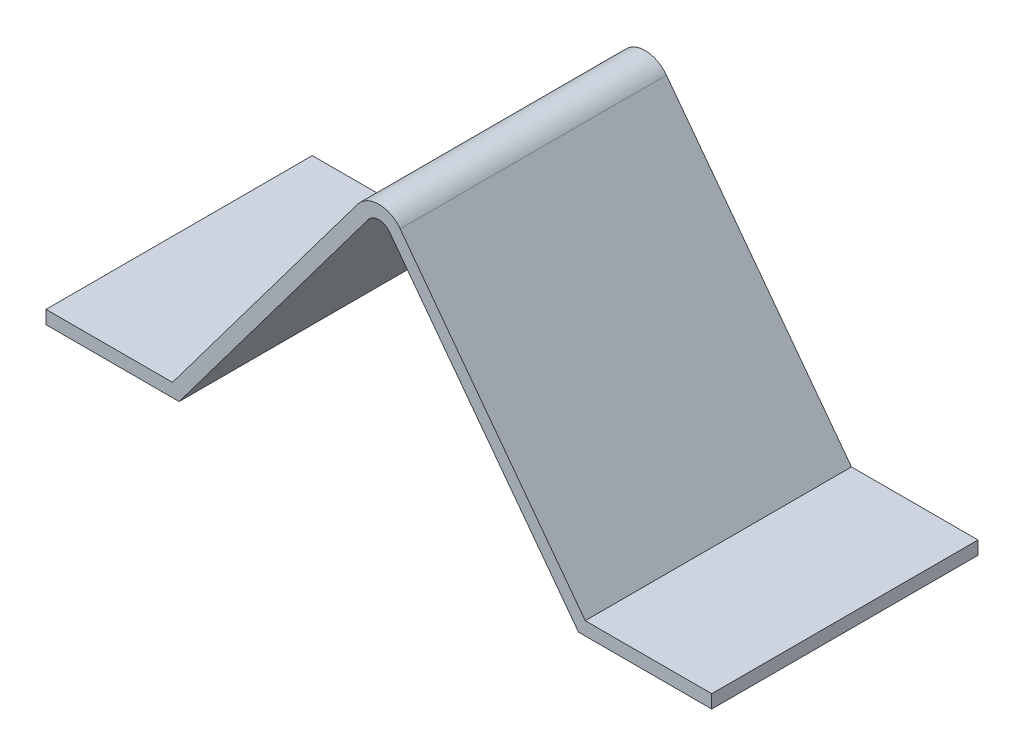
ISO-10303-21;
HEADER;
FILE_DESCRIPTION(('STEP AP214'),'2;1');
FILE_NAME('part.step','',(''),(''),'','','');
FILE_SCHEMA(('AUTOMOTIVE_DESIGN { 1 0 10303 214 1 1 1 1 }'));
ENDSEC;
DATA;
#1=APPLICATION_CONTEXT('core data for automotive mechanical design processes');
#2=APPLICATION_PROTOCOL_DEFINITION('international standard','automotive_design',2000,#1);
#3=PRODUCT_CONTEXT('',#1,'mechanical');
#4=PRODUCT('Part','Part','',(#3));
#5=PRODUCT_RELATED_PRODUCT_CATEGORY('part','',(#4));
#6=PRODUCT_DEFINITION_FORMATION('','',#4);
#7=PRODUCT_DEFINITION_CONTEXT('part definition',#1,'design');
#8=PRODUCT_DEFINITION('design','',#6,#7);
#9=PRODUCT_DEFINITION_SHAPE('','',#8);
#10=(LENGTH_UNIT() NAMED_UNIT(*) SI_UNIT(.MILLI.,.METRE.));
#11=(NAMED_UNIT(*) PLANE_ANGLE_UNIT() SI_UNIT($,.RADIAN.));
#12=(NAMED_UNIT(*) SI_UNIT($,.STERADIAN.) SOLID_ANGLE_UNIT());
#13=UNCERTAINTY_MEASURE_WITH_UNIT(LENGTH_MEASURE(1.E-05),#10,'distance_accuracy_value','');
#14=(GEOMETRIC_REPRESENTATION_CONTEXT(3) GLOBAL_UNCERTAINTY_ASSIGNED_CONTEXT((#13)) GLOBAL_UNIT_ASSIGNED_CONTEXT((#10,
#11,#12)) REPRESENTATION_CONTEXT('',''));
#15=CARTESIAN_POINT('',(0.,0.,0.));
#16=DIRECTION('',(0.,0.,1.));
#17=DIRECTION('',(1.,0.,0.));
#18=AXIS2_PLACEMENT_3D('',#15,#16,#17);
#19=CARTESIAN_POINT('',(-15.,0.,10.));
#20=DIRECTION('',(0.,1.,0.));
#21=DIRECTION('',(-1.,0.,0.));
#22=AXIS2_PLACEMENT_3D('',#19,#20,#21);
#23=PLANE('',#22);
#24=DIRECTION('',(1.,0.,0.));
#25=VECTOR('',#24,1.);
#26=CARTESIAN_POINT('',(-15.,0.,-10.));
#27=LINE('',#26,#25);
#28=CARTESIAN_POINT('',(-25.,0.,-10.));
#29=VERTEX_POINT('',#28);
#30=CARTESIAN_POINT('',(-15.,0.,-10.));
#31=VERTEX_POINT('',#30);
#32=EDGE_CURVE('E148',#29,#31,#27,.T.);
#33=ORIENTED_EDGE('',*,*,#32,.T.);
#34=DIRECTION('',(0.,0.,-1.));
#35=VECTOR('',#34,1.);
#36=CARTESIAN_POINT('',(-15.,0.,10.));
#37=LINE('',#36,#35);
#38=CARTESIAN_POINT('',(-15.,0.,10.));
#39=VERTEX_POINT('',#38);
#40=EDGE_CURVE('E129',#39,#31,#37,.T.);
#41=ORIENTED_EDGE('',*,*,#40,.F.);
#42=DIRECTION('',(1.,0.,0.));
#43=VECTOR('',#42,1.);
#44=CARTESIAN_POINT('',(-15.,0.,10.));
#45=LINE('',#44,#43);
#46=CARTESIAN_POINT('',(-25.,0.,10.));
#47=VERTEX_POINT('',#46);
#48=EDGE_CURVE('E136',#47,#39,#45,.T.);
#49=ORIENTED_EDGE('',*,*,#48,.F.);
#50=DIRECTION('',(0.,0.,-1.));
#51=VECTOR('',#50,1.);
#52=CARTESIAN_POINT('',(-25.,0.,10.));
#53=LINE('',#52,#51);
#54=EDGE_CURVE('E189',#47,#29,#53,.T.);
#55=ORIENTED_EDGE('',*,*,#54,.T.);
#56=EDGE_LOOP('',(#33,#41,#49,#55));
#57=FACE_BOUND('',#56,.T.);
#58=ADVANCED_FACE('F35',(#57),#23,.F.);
#59=CARTESIAN_POINT('',(-15.,0.,10.));
#60=DIRECTION('',(-0.8,0.6,0.));
#61=DIRECTION('',(-0.6,-0.8,0.));
#62=AXIS2_PLACEMENT_3D('',#59,#60,#61);
#63=PLANE('',#62);
#64=DIRECTION('',(0.6,0.8,0.));
#65=VECTOR('',#64,1.);
#66=CARTESIAN_POINT('',(-15.,0.,-10.));
#67=LINE('',#66,#65);
#68=CARTESIAN_POINT('',(-0.799999999999999,18.9333333333333,-10.));
#69=VERTEX_POINT('',#68);
#70=EDGE_CURVE('E221',#31,#69,#67,.T.);
#71=ORIENTED_EDGE('',*,*,#70,.T.);
#72=DIRECTION('',(0.,0.,-1.));
#73=VECTOR('',#72,1.);
#74=CARTESIAN_POINT('',(-0.799999999999998,18.9333333333333,10.));
#75=LINE('',#74,#73);
#76=CARTESIAN_POINT('',(-0.799999999999999,18.9333333333333,10.));
#77=VERTEX_POINT('',#76);
#78=EDGE_CURVE('E132',#69,#77,#75,.F.);
#79=ORIENTED_EDGE('',*,*,#78,.T.);
#80=DIRECTION('',(0.6,0.8,0.));
#81=VECTOR('',#80,1.);
#82=CARTESIAN_POINT('',(-15.,0.,10.));
#83=LINE('',#82,#81);
#84=EDGE_CURVE('E124',#39,#77,#83,.T.);
#85=ORIENTED_EDGE('',*,*,#84,.F.);
#86=ORIENTED_EDGE('',*,*,#40,.T.);
#87=EDGE_LOOP('',(#71,#79,#85,#86));
#88=FACE_BOUND('',#87,.T.);
#89=ADVANCED_FACE('F127',(#88),#63,.F.);
#90=CARTESIAN_POINT('',(15.,0.,10.));
#91=DIRECTION('',(0.8,0.6,0.));
#92=DIRECTION('',(-0.6,0.8,0.));
#93=AXIS2_PLACEMENT_3D('',#90,#91,#92);
#94=PLANE('',#93);
#95=DIRECTION('',(0.6,-0.8,0.));
#96=VECTOR('',#95,1.);
#97=CARTESIAN_POINT('',(15.,0.,10.));
#98=LINE('',#97,#96);
#99=CARTESIAN_POINT('',(0.799999999999999,18.9333333333333,10.));
#100=VERTEX_POINT('',#99);
#101=CARTESIAN_POINT('',(15.,0.,10.));
#102=VERTEX_POINT('',#101);
#103=EDGE_CURVE('E135',#100,#102,#98,.T.);
#104=ORIENTED_EDGE('',*,*,#103,.F.);
#105=DIRECTION('',(0.,0.,-1.));
#106=VECTOR('',#105,1.);
#107=CARTESIAN_POINT('',(0.799999999999999,18.9333333333333,-10.));
#108=LINE('',#107,#106);
#109=CARTESIAN_POINT('',(0.799999999999999,18.9333333333333,-10.));
#110=VERTEX_POINT('',#109);
#111=EDGE_CURVE('E149',#100,#110,#108,.T.);
#112=ORIENTED_EDGE('',*,*,#111,.T.);
#113=DIRECTION('',(0.6,-0.8,0.));
#114=VECTOR('',#113,1.);
#115=CARTESIAN_POINT('',(15.,0.,-10.));
#116=LINE('',#115,#114);
#117=CARTESIAN_POINT('',(15.,0.,-10.));
#118=VERTEX_POINT('',#117);
#119=EDGE_CURVE('E217',#110,#118,#116,.T.);
#120=ORIENTED_EDGE('',*,*,#119,.T.);
#121=DIRECTION('',(0.,0.,-1.));
#122=VECTOR('',#121,1.);
#123=CARTESIAN_POINT('',(15.,0.,10.));
#124=LINE('',#123,#122);
#125=EDGE_CURVE('E150',#102,#118,#124,.T.);
#126=ORIENTED_EDGE('',*,*,#125,.F.);
#127=EDGE_LOOP('',(#104,#112,#120,#126));
#128=FACE_BOUND('',#127,.T.);
#129=ADVANCED_FACE('F239',(#128),#94,.F.);
#130=CARTESIAN_POINT('',(15.,0.,10.));
#131=DIRECTION('',(0.,1.,0.));
#132=DIRECTION('',(-1.,0.,0.));
#133=AXIS2_PLACEMENT_3D('',#130,#131,#132);
#134=PLANE('',#133);
#135=DIRECTION('',(1.,0.,0.));
#136=VECTOR('',#135,1.);
#137=CARTESIAN_POINT('',(15.,0.,-10.));
#138=LINE('',#137,#136);
#139=CARTESIAN_POINT('',(25.,0.,-10.));
#140=VERTEX_POINT('',#139);
#141=EDGE_CURVE('E215',#118,#140,#138,.T.);
#142=ORIENTED_EDGE('',*,*,#141,.T.);
#143=DIRECTION('',(0.,0.,-1.));
#144=VECTOR('',#143,1.);
#145=CARTESIAN_POINT('',(25.,0.,10.));
#146=LINE('',#145,#144);
#147=CARTESIAN_POINT('',(25.,0.,10.));
#148=VERTEX_POINT('',#147);
#149=EDGE_CURVE('E155',#148,#140,#146,.T.);
#150=ORIENTED_EDGE('',*,*,#149,.F.);
#151=DIRECTION('',(1.,0.,0.));
#152=VECTOR('',#151,1.);
#153=CARTESIAN_POINT('',(15.,0.,10.));
#154=LINE('',#153,#152);
#155=EDGE_CURVE('E233',#102,#148,#154,.T.);
#156=ORIENTED_EDGE('',*,*,#155,.F.);
#157=ORIENTED_EDGE('',*,*,#125,.T.);
#158=EDGE_LOOP('',(#142,#150,#156,#157));
#159=FACE_BOUND('',#158,.T.);
#160=ADVANCED_FACE('F240',(#159),#134,.F.);
#161=CARTESIAN_POINT('',(25.,0.,10.));
#162=DIRECTION('',(-1.,0.,0.));
#163=DIRECTION('',(0.,0.,1.));
#164=AXIS2_PLACEMENT_3D('',#161,#162,#163);
#165=PLANE('',#164);
#166=DIRECTION('',(0.,1.,0.));
#167=VECTOR('',#166,1.);
#168=CARTESIAN_POINT('',(25.,0.,-10.));
#169=LINE('',#168,#167);
#170=CARTESIAN_POINT('',(25.,1.00000000000001,-10.));
#171=VERTEX_POINT('',#170);
#172=EDGE_CURVE('E208',#140,#171,#169,.T.);
#173=ORIENTED_EDGE('',*,*,#172,.T.);
#174=DIRECTION('',(0.,0.,-1.));
#175=VECTOR('',#174,1.);
#176=CARTESIAN_POINT('',(25.,1.00000000000001,10.));
#177=LINE('',#176,#175);
#178=CARTESIAN_POINT('',(25.,1.00000000000001,10.));
#179=VERTEX_POINT('',#178);
#180=EDGE_CURVE('E199',#179,#171,#177,.T.);
#181=ORIENTED_EDGE('',*,*,#180,.F.);
#182=DIRECTION('',(0.,1.,0.));
#183=VECTOR('',#182,1.);
#184=CARTESIAN_POINT('',(25.,0.,10.));
#185=LINE('',#184,#183);
#186=EDGE_CURVE('E209',#148,#179,#185,.T.);
#187=ORIENTED_EDGE('',*,*,#186,.F.);
#188=ORIENTED_EDGE('',*,*,#149,.T.);
#189=EDGE_LOOP('',(#173,#181,#187,#188));
#190=FACE_BOUND('',#189,.T.);
#191=ADVANCED_FACE('F206',(#190),#165,.F.);
#192=CARTESIAN_POINT('',(15.5,1.,10.));
#193=DIRECTION('',(0.,-1.,0.));
#194=DIRECTION('',(1.,0.,0.));
#195=AXIS2_PLACEMENT_3D('',#192,#193,#194);
#196=PLANE('',#195);
#197=DIRECTION('',(-1.,0.,0.));
#198=VECTOR('',#197,1.);
#199=CARTESIAN_POINT('',(15.5,1.,-10.));
#200=LINE('',#199,#198);
#201=CARTESIAN_POINT('',(15.5,1.,-10.));
#202=VERTEX_POINT('',#201);
#203=EDGE_CURVE('E184',#171,#202,#200,.T.);
#204=ORIENTED_EDGE('',*,*,#203,.T.);
#205=DIRECTION('',(0.,0.,-1.));
#206=VECTOR('',#205,1.);
#207=CARTESIAN_POINT('',(15.5,1.,10.));
#208=LINE('',#207,#206);
#209=CARTESIAN_POINT('',(15.5,1.,10.));
#210=VERTEX_POINT('',#209);
#211=EDGE_CURVE('E196',#210,#202,#208,.T.);
#212=ORIENTED_EDGE('',*,*,#211,.F.);
#213=DIRECTION('',(-1.,0.,0.));
#214=VECTOR('',#213,1.);
#215=CARTESIAN_POINT('',(15.5,1.,10.));
#216=LINE('',#215,#214);
#217=EDGE_CURVE('E230',#179,#210,#216,.T.);
#218=ORIENTED_EDGE('',*,*,#217,.F.);
#219=ORIENTED_EDGE('',*,*,#180,.T.);
#220=EDGE_LOOP('',(#204,#212,#218,#219));
#221=FACE_BOUND('',#220,.T.);
#222=ADVANCED_FACE('F247',(#221),#196,.F.);
#223=CARTESIAN_POINT('',(15.5,1.,10.));
#224=DIRECTION('',(-0.8,-0.6,0.));
#225=DIRECTION('',(0.6,-0.8,0.));
#226=AXIS2_PLACEMENT_3D('',#223,#224,#225);
#227=PLANE('',#226);
#228=DIRECTION('',(-0.6,0.8,0.));
#229=VECTOR('',#228,1.);
#230=CARTESIAN_POINT('',(15.5,1.,-10.));
#231=LINE('',#230,#229);
#232=CARTESIAN_POINT('',(1.6,19.5333333333333,-10.));
#233=VERTEX_POINT('',#232);
#234=EDGE_CURVE('E181',#202,#233,#231,.T.);
#235=ORIENTED_EDGE('',*,*,#234,.T.);
#236=DIRECTION('',(0.,0.,-1.));
#237=VECTOR('',#236,1.);
#238=CARTESIAN_POINT('',(1.6,19.5333333333333,10.));
#239=LINE('',#238,#237);
#240=CARTESIAN_POINT('',(1.6,19.5333333333333,10.));
#241=VERTEX_POINT('',#240);
#242=EDGE_CURVE('E43',#233,#241,#239,.F.);
#243=ORIENTED_EDGE('',*,*,#242,.T.);
#244=DIRECTION('',(-0.6,0.8,0.));
#245=VECTOR('',#244,1.);
#246=CARTESIAN_POINT('',(15.5,1.,10.));
#247=LINE('',#246,#245);
#248=EDGE_CURVE('E228',#210,#241,#247,.T.);
#249=ORIENTED_EDGE('',*,*,#248,.F.);
#250=ORIENTED_EDGE('',*,*,#211,.T.);
#251=EDGE_LOOP('',(#235,#243,#249,#250));
#252=FACE_BOUND('',#251,.T.);
#253=ADVANCED_FACE('F272',(#252),#227,.F.);
#254=CARTESIAN_POINT('',(-15.5,1.,10.));
#255=DIRECTION('',(0.8,-0.6,0.));
#256=DIRECTION('',(0.6,0.8,0.));
#257=AXIS2_PLACEMENT_3D('',#254,#255,#256);
#258=PLANE('',#257);
#259=DIRECTION('',(-0.6,-0.8,0.));
#260=VECTOR('',#259,1.);
#261=CARTESIAN_POINT('',(-15.5,1.,10.));
#262=LINE('',#261,#260);
#263=CARTESIAN_POINT('',(-1.59999999999999,19.5333333333333,10.));
#264=VERTEX_POINT('',#263);
#265=CARTESIAN_POINT('',(-15.5,1.,10.));
#266=VERTEX_POINT('',#265);
#267=EDGE_CURVE('E174',#264,#266,#262,.T.);
#268=ORIENTED_EDGE('',*,*,#267,.F.);
#269=DIRECTION('',(0.,0.,-1.));
#270=VECTOR('',#269,1.);
#271=CARTESIAN_POINT('',(-1.59999999999999,19.5333333333333,10.));
#272=LINE('',#271,#270);
#273=CARTESIAN_POINT('',(-1.59999999999999,19.5333333333333,-10.));
#274=VERTEX_POINT('',#273);
#275=EDGE_CURVE('E164',#264,#274,#272,.T.);
#276=ORIENTED_EDGE('',*,*,#275,.T.);
#277=DIRECTION('',(-0.6,-0.8,0.));
#278=VECTOR('',#277,1.);
#279=CARTESIAN_POINT('',(-15.5,1.,-10.));
#280=LINE('',#279,#278);
#281=CARTESIAN_POINT('',(-15.5,1.,-10.));
#282=VERTEX_POINT('',#281);
#283=EDGE_CURVE('E172',#274,#282,#280,.T.);
#284=ORIENTED_EDGE('',*,*,#283,.T.);
#285=DIRECTION('',(0.,0.,-1.));
#286=VECTOR('',#285,1.);
#287=CARTESIAN_POINT('',(-15.5,1.,10.));
#288=LINE('',#287,#286);
#289=EDGE_CURVE('E194',#266,#282,#288,.T.);
#290=ORIENTED_EDGE('',*,*,#289,.F.);
#291=EDGE_LOOP('',(#268,#276,#284,#290));
#292=FACE_BOUND('',#291,.T.);
#293=ADVANCED_FACE('F170',(#292),#258,.F.);
#294=CARTESIAN_POINT('',(-15.5,1.,10.));
#295=DIRECTION('',(0.,-1.,0.));
#296=DIRECTION('',(1.,0.,0.));
#297=AXIS2_PLACEMENT_3D('',#294,#295,#296);
#298=PLANE('',#297);
#299=DIRECTION('',(-1.,0.,0.));
#300=VECTOR('',#299,1.);
#301=CARTESIAN_POINT('',(-15.5,1.,-10.));
#302=LINE('',#301,#300);
#303=CARTESIAN_POINT('',(-25.,0.999999999999999,-10.));
#304=VERTEX_POINT('',#303);
#305=EDGE_CURVE('E180',#282,#304,#302,.T.);
#306=ORIENTED_EDGE('',*,*,#305,.T.);
#307=DIRECTION('',(0.,0.,-1.));
#308=VECTOR('',#307,1.);
#309=CARTESIAN_POINT('',(-25.,0.999999999999999,10.));
#310=LINE('',#309,#308);
#311=CARTESIAN_POINT('',(-25.,0.999999999999999,10.));
#312=VERTEX_POINT('',#311);
#313=EDGE_CURVE('E191',#312,#304,#310,.T.);
#314=ORIENTED_EDGE('',*,*,#313,.F.);
#315=DIRECTION('',(-1.,0.,0.));
#316=VECTOR('',#315,1.);
#317=CARTESIAN_POINT('',(-15.5,1.,10.));
#318=LINE('',#317,#316);
#319=EDGE_CURVE('E225',#266,#312,#318,.T.);
#320=ORIENTED_EDGE('',*,*,#319,.F.);
#321=ORIENTED_EDGE('',*,*,#289,.T.);
#322=EDGE_LOOP('',(#306,#314,#320,#321));
#323=FACE_BOUND('',#322,.T.);
#324=ADVANCED_FACE('F269',(#323),#298,.F.);
#325=CARTESIAN_POINT('',(-25.,0.,10.));
#326=DIRECTION('',(1.,0.,0.));
#327=DIRECTION('',(0.,0.,-1.));
#328=AXIS2_PLACEMENT_3D('',#325,#326,#327);
#329=PLANE('',#328);
#330=DIRECTION('',(0.,-1.,0.));
#331=VECTOR('',#330,1.);
#332=CARTESIAN_POINT('',(-25.,0.,-10.));
#333=LINE('',#332,#331);
#334=EDGE_CURVE('E145',#304,#29,#333,.T.);
#335=ORIENTED_EDGE('',*,*,#334,.T.);
#336=ORIENTED_EDGE('',*,*,#54,.F.);
#337=DIRECTION('',(0.,-1.,0.));
#338=VECTOR('',#337,1.);
#339=CARTESIAN_POINT('',(-25.,0.,10.));
#340=LINE('',#339,#338);
#341=EDGE_CURVE('E141',#312,#47,#340,.T.);
#342=ORIENTED_EDGE('',*,*,#341,.F.);
#343=ORIENTED_EDGE('',*,*,#313,.T.);
#344=EDGE_LOOP('',(#335,#336,#342,#343));
#345=FACE_BOUND('',#344,.T.);
#346=ADVANCED_FACE('F265',(#345),#329,.F.);
#347=CARTESIAN_POINT('',(0.,0.,10.));
#348=DIRECTION('',(0.,0.,-1.));
#349=DIRECTION('',(-1.,0.,0.));
#350=AXIS2_PLACEMENT_3D('',#347,#348,#349);
#351=PLANE('',#350);
#352=ORIENTED_EDGE('',*,*,#248,.T.);
#353=CARTESIAN_POINT('',(0.,18.3333333333333,10.));
#354=DIRECTION('',(0.,0.,-1.));
#355=DIRECTION('',(-1.,0.,0.));
#356=AXIS2_PLACEMENT_3D('',#353,#354,#355);
#357=CIRCLE('',#356,2.);
#358=EDGE_CURVE('E11',#241,#264,#357,.F.);
#359=ORIENTED_EDGE('',*,*,#358,.T.);
#360=ORIENTED_EDGE('',*,*,#267,.T.);
#361=ORIENTED_EDGE('',*,*,#319,.T.);
#362=ORIENTED_EDGE('',*,*,#341,.T.);
#363=ORIENTED_EDGE('',*,*,#48,.T.);
#364=ORIENTED_EDGE('',*,*,#84,.T.);
#365=CARTESIAN_POINT('',(0.,18.3333333333333,10.));
#366=DIRECTION('',(0.,0.,-1.));
#367=DIRECTION('',(-1.,0.,0.));
#368=AXIS2_PLACEMENT_3D('',#365,#366,#367);
#369=CIRCLE('',#368,1.);
#370=EDGE_CURVE('E162',#77,#100,#369,.T.);
#371=ORIENTED_EDGE('',*,*,#370,.T.);
#372=ORIENTED_EDGE('',*,*,#103,.T.);
#373=ORIENTED_EDGE('',*,*,#155,.T.);
#374=ORIENTED_EDGE('',*,*,#186,.T.);
#375=ORIENTED_EDGE('',*,*,#217,.T.);
#376=EDGE_LOOP('',(#352,#359,#360,#361,#362,#363,#364,#371,#372,#373,#374,#375));
#377=FACE_BOUND('',#376,.T.);
#378=ADVANCED_FACE('F139',(#377),#351,.F.);
#379=CARTESIAN_POINT('',(0.,0.,-10.));
#380=DIRECTION('',(0.,0.,-1.));
#381=DIRECTION('',(-1.,0.,0.));
#382=AXIS2_PLACEMENT_3D('',#379,#380,#381);
#383=PLANE('',#382);
#384=ORIENTED_EDGE('',*,*,#283,.F.);
#385=CARTESIAN_POINT('',(0.,18.3333333333333,-10.));
#386=DIRECTION('',(0.,0.,-1.));
#387=DIRECTION('',(-1.,0.,0.));
#388=AXIS2_PLACEMENT_3D('',#385,#386,#387);
#389=CIRCLE('',#388,2.);
#390=EDGE_CURVE('E57',#274,#233,#389,.T.);
#391=ORIENTED_EDGE('',*,*,#390,.T.);
#392=ORIENTED_EDGE('',*,*,#234,.F.);
#393=ORIENTED_EDGE('',*,*,#203,.F.);
#394=ORIENTED_EDGE('',*,*,#172,.F.);
#395=ORIENTED_EDGE('',*,*,#141,.F.);
#396=ORIENTED_EDGE('',*,*,#119,.F.);
#397=CARTESIAN_POINT('',(0.,18.3333333333333,-10.));
#398=DIRECTION('',(0.,0.,-1.));
#399=DIRECTION('',(-1.,0.,0.));
#400=AXIS2_PLACEMENT_3D('',#397,#398,#399);
#401=CIRCLE('',#400,1.);
#402=EDGE_CURVE('E160',#110,#69,#401,.F.);
#403=ORIENTED_EDGE('',*,*,#402,.T.);
#404=ORIENTED_EDGE('',*,*,#70,.F.);
#405=ORIENTED_EDGE('',*,*,#32,.F.);
#406=ORIENTED_EDGE('',*,*,#334,.F.);
#407=ORIENTED_EDGE('',*,*,#305,.F.);
#408=EDGE_LOOP('',(#384,#391,#392,#393,#394,#395,#396,#403,#404,#405,#406,#407));
#409=FACE_BOUND('',#408,.T.);
#410=ADVANCED_FACE('F178',(#409),#383,.T.);
#411=CARTESIAN_POINT('',(0.,18.3333333333333,10.));
#412=DIRECTION('',(0.,0.,1.));
#413=DIRECTION('',(1.,0.,0.));
#414=AXIS2_PLACEMENT_3D('',#411,#412,#413);
#415=CYLINDRICAL_SURFACE('',#414,1.);
#416=ORIENTED_EDGE('',*,*,#370,.F.);
#417=ORIENTED_EDGE('',*,*,#78,.F.);
#418=ORIENTED_EDGE('',*,*,#402,.F.);
#419=ORIENTED_EDGE('',*,*,#111,.F.);
#420=EDGE_LOOP('',(#416,#417,#418,#419));
#421=FACE_BOUND('',#420,.T.);
#422=ADVANCED_FACE('F256',(#421),#415,.F.);
#423=CARTESIAN_POINT('',(0.,18.3333333333333,10.));
#424=DIRECTION('',(0.,0.,-1.));
#425=DIRECTION('',(-1.,0.,0.));
#426=AXIS2_PLACEMENT_3D('',#423,#424,#425);
#427=CYLINDRICAL_SURFACE('',#426,2.);
#428=ORIENTED_EDGE('',*,*,#358,.F.);
#429=ORIENTED_EDGE('',*,*,#242,.F.);
#430=ORIENTED_EDGE('',*,*,#390,.F.);
#431=ORIENTED_EDGE('',*,*,#275,.F.);
#432=EDGE_LOOP('',(#428,#429,#430,#431));
#433=FACE_BOUND('',#432,.T.);
#434=ADVANCED_FACE('F37',(#433),#427,.T.);
#435=CLOSED_SHELL('',(#58,#89,#129,#160,#191,#222,#253,#293,#324,#346,#378,#410,#422,#434));
#436=MANIFOLD_SOLID_BREP('B2',#435);
#437=ADVANCED_BREP_SHAPE_REPRESENTATION('',(#18,#436),#14);
#438=SHAPE_DEFINITION_REPRESENTATION(#9,#437);
ENDSEC;
END-ISO-10303-21;
